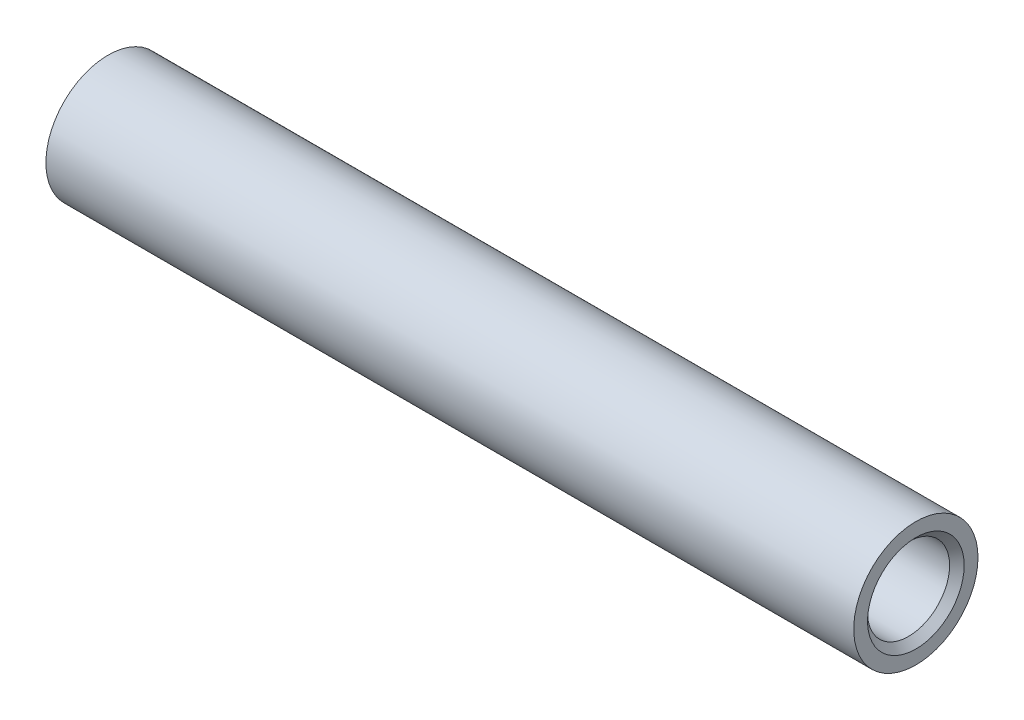
ISO-10303-21;
HEADER;
FILE_DESCRIPTION(('STEP AP214'),'2;1');
FILE_NAME('part.step','',(''),(''),'','','');
FILE_SCHEMA(('AUTOMOTIVE_DESIGN { 1 0 10303 214 1 1 1 1 }'));
ENDSEC;
DATA;
#1=APPLICATION_CONTEXT('core data for automotive mechanical design processes');
#2=APPLICATION_PROTOCOL_DEFINITION('international standard','automotive_design',2000,#1);
#3=PRODUCT_CONTEXT('',#1,'mechanical');
#4=PRODUCT('Part','Part','',(#3));
#5=PRODUCT_RELATED_PRODUCT_CATEGORY('part','',(#4));
#6=PRODUCT_DEFINITION_FORMATION('','',#4);
#7=PRODUCT_DEFINITION_CONTEXT('part definition',#1,'design');
#8=PRODUCT_DEFINITION('design','',#6,#7);
#9=PRODUCT_DEFINITION_SHAPE('','',#8);
#10=(LENGTH_UNIT() NAMED_UNIT(*) SI_UNIT(.MILLI.,.METRE.));
#11=(NAMED_UNIT(*) PLANE_ANGLE_UNIT() SI_UNIT($,.RADIAN.));
#12=(NAMED_UNIT(*) SI_UNIT($,.STERADIAN.) SOLID_ANGLE_UNIT());
#13=UNCERTAINTY_MEASURE_WITH_UNIT(LENGTH_MEASURE(1.E-05),#10,'distance_accuracy_value','');
#14=(GEOMETRIC_REPRESENTATION_CONTEXT(3) GLOBAL_UNCERTAINTY_ASSIGNED_CONTEXT((#13)) GLOBAL_UNIT_ASSIGNED_CONTEXT((#10,
#11,#12)) REPRESENTATION_CONTEXT('',''));
#15=CARTESIAN_POINT('',(0.,0.,0.));
#16=DIRECTION('',(0.,0.,1.));
#17=DIRECTION('',(1.,0.,0.));
#18=AXIS2_PLACEMENT_3D('',#15,#16,#17);
#19=CARTESIAN_POINT('',(65.,0.,0.));
#20=DIRECTION('',(-1.,0.,0.));
#21=DIRECTION('',(0.,0.,1.));
#22=AXIS2_PLACEMENT_3D('',#19,#20,#21);
#23=CYLINDRICAL_SURFACE('',#22,5.);
#24=CARTESIAN_POINT('',(65.,0.,0.));
#25=DIRECTION('',(1.,0.,0.));
#26=DIRECTION('',(0.,0.,-1.));
#27=AXIS2_PLACEMENT_3D('',#24,#25,#26);
#28=CIRCLE('',#27,5.);
#29=CARTESIAN_POINT('',(65.,0.,-5.));
#30=VERTEX_POINT('',#29);
#31=EDGE_CURVE('E11',#30,#30,#28,.T.);
#32=ORIENTED_EDGE('',*,*,#31,.F.);
#33=EDGE_LOOP('',(#32));
#34=FACE_BOUND('',#33,.T.);
#35=CARTESIAN_POINT('',(0.,0.,0.));
#36=DIRECTION('',(1.,0.,0.));
#37=DIRECTION('',(0.,0.,-1.));
#38=AXIS2_PLACEMENT_3D('',#35,#36,#37);
#39=CIRCLE('',#38,5.);
#40=CARTESIAN_POINT('',(0.,0.,-5.));
#41=VERTEX_POINT('',#40);
#42=EDGE_CURVE('E46',#41,#41,#39,.T.);
#43=ORIENTED_EDGE('',*,*,#42,.T.);
#44=EDGE_LOOP('',(#43));
#45=FACE_BOUND('',#44,.T.);
#46=ADVANCED_FACE('F43',(#34,#45),#23,.T.);
#47=CARTESIAN_POINT('',(65.,0.,0.));
#48=DIRECTION('',(1.,0.,0.));
#49=DIRECTION('',(0.,0.,-1.));
#50=AXIS2_PLACEMENT_3D('',#47,#48,#49);
#51=PLANE('',#50);
#52=CARTESIAN_POINT('',(65.,0.,0.));
#53=DIRECTION('',(1.,0.,0.));
#54=DIRECTION('',(0.,0.,-1.));
#55=AXIS2_PLACEMENT_3D('',#52,#53,#54);
#56=CIRCLE('',#55,3.8865);
#57=CARTESIAN_POINT('',(65.,0.,-3.8865));
#58=VERTEX_POINT('',#57);
#59=EDGE_CURVE('E77',#58,#58,#56,.T.);
#60=ORIENTED_EDGE('',*,*,#59,.F.);
#61=EDGE_LOOP('',(#60));
#62=FACE_BOUND('',#61,.T.);
#63=ORIENTED_EDGE('',*,*,#31,.T.);
#64=EDGE_LOOP('',(#63));
#65=FACE_BOUND('',#64,.T.);
#66=ADVANCED_FACE('F97',(#62,#65),#51,.T.);
#67=CARTESIAN_POINT('',(0.,0.,0.));
#68=DIRECTION('',(1.,0.,0.));
#69=DIRECTION('',(0.,0.,-1.));
#70=AXIS2_PLACEMENT_3D('',#67,#68,#69);
#71=PLANE('',#70);
#72=CARTESIAN_POINT('',(0.,0.,0.));
#73=DIRECTION('',(-1.,0.,0.));
#74=DIRECTION('',(0.,0.,1.));
#75=AXIS2_PLACEMENT_3D('',#72,#73,#74);
#76=CIRCLE('',#75,3.8865);
#77=CARTESIAN_POINT('',(0.,0.,3.8865));
#78=VERTEX_POINT('',#77);
#79=EDGE_CURVE('E68',#78,#78,#76,.T.);
#80=ORIENTED_EDGE('',*,*,#79,.F.);
#81=EDGE_LOOP('',(#80));
#82=FACE_BOUND('',#81,.T.);
#83=ORIENTED_EDGE('',*,*,#42,.F.);
#84=EDGE_LOOP('',(#83));
#85=FACE_BOUND('',#84,.T.);
#86=ADVANCED_FACE('F94',(#82,#85),#71,.F.);
#87=CARTESIAN_POINT('',(20.,0.,0.));
#88=DIRECTION('',(-1.,0.,0.));
#89=DIRECTION('',(0.,0.,1.));
#90=AXIS2_PLACEMENT_3D('',#87,#88,#89);
#91=CONICAL_SURFACE('',#90,3.3,1.02974425867665);
#92=CARTESIAN_POINT('',(21.982840042791,0.,0.));
#93=VERTEX_POINT('',#92);
#94=VERTEX_LOOP('',#93);
#95=FACE_BOUND('',#94,.T.);
#96=CARTESIAN_POINT('',(20.,0.,0.));
#97=DIRECTION('',(-1.,0.,0.));
#98=DIRECTION('',(0.,0.,1.));
#99=AXIS2_PLACEMENT_3D('',#96,#97,#98);
#100=CIRCLE('',#99,3.3);
#101=CARTESIAN_POINT('',(20.,0.,3.3));
#102=VERTEX_POINT('',#101);
#103=EDGE_CURVE('E84',#102,#102,#100,.T.);
#104=ORIENTED_EDGE('',*,*,#103,.T.);
#105=EDGE_LOOP('',(#104));
#106=FACE_BOUND('',#105,.T.);
#107=ADVANCED_FACE('F96',(#95,#106),#91,.F.);
#108=CARTESIAN_POINT('',(0.,0.,0.));
#109=DIRECTION('',(-1.,0.,0.));
#110=DIRECTION('',(0.,0.,1.));
#111=AXIS2_PLACEMENT_3D('',#108,#109,#110);
#112=CYLINDRICAL_SURFACE('',#111,3.3);
#113=ORIENTED_EDGE('',*,*,#103,.F.);
#114=EDGE_LOOP('',(#113));
#115=FACE_BOUND('',#114,.T.);
#116=CARTESIAN_POINT('',(0.5865,0.,0.));
#117=DIRECTION('',(-1.,0.,0.));
#118=DIRECTION('',(0.,0.,1.));
#119=AXIS2_PLACEMENT_3D('',#116,#117,#118);
#120=CIRCLE('',#119,3.3);
#121=CARTESIAN_POINT('',(0.5865,0.,3.3));
#122=VERTEX_POINT('',#121);
#123=EDGE_CURVE('E74',#122,#122,#120,.T.);
#124=ORIENTED_EDGE('',*,*,#123,.T.);
#125=EDGE_LOOP('',(#124));
#126=FACE_BOUND('',#125,.T.);
#127=ADVANCED_FACE('F103',(#115,#126),#112,.F.);
#128=CARTESIAN_POINT('',(0.,0.,0.));
#129=DIRECTION('',(-1.,0.,0.));
#130=DIRECTION('',(0.,0.,1.));
#131=AXIS2_PLACEMENT_3D('',#128,#129,#130);
#132=CONICAL_SURFACE('',#131,3.8865,0.785398163397448);
#133=ORIENTED_EDGE('',*,*,#123,.F.);
#134=EDGE_LOOP('',(#133));
#135=FACE_BOUND('',#134,.T.);
#136=ORIENTED_EDGE('',*,*,#79,.T.);
#137=EDGE_LOOP('',(#136));
#138=FACE_BOUND('',#137,.T.);
#139=ADVANCED_FACE('F61',(#135,#138),#132,.F.);
#140=CARTESIAN_POINT('',(45.,0.,0.));
#141=DIRECTION('',(1.,0.,0.));
#142=DIRECTION('',(0.,0.,-1.));
#143=AXIS2_PLACEMENT_3D('',#140,#141,#142);
#144=CONICAL_SURFACE('',#143,3.29999999999999,1.02974425867665);
#145=CARTESIAN_POINT('',(43.0171599572091,0.,0.));
#146=VERTEX_POINT('',#145);
#147=VERTEX_LOOP('',#146);
#148=FACE_BOUND('',#147,.T.);
#149=CARTESIAN_POINT('',(45.,0.,0.));
#150=DIRECTION('',(1.,0.,0.));
#151=DIRECTION('',(0.,0.,-1.));
#152=AXIS2_PLACEMENT_3D('',#149,#150,#151);
#153=CIRCLE('',#152,3.29999999999999);
#154=CARTESIAN_POINT('',(45.,0.,-3.29999999999999));
#155=VERTEX_POINT('',#154);
#156=EDGE_CURVE('E65',#155,#155,#153,.T.);
#157=ORIENTED_EDGE('',*,*,#156,.T.);
#158=EDGE_LOOP('',(#157));
#159=FACE_BOUND('',#158,.T.);
#160=ADVANCED_FACE('F57',(#148,#159),#144,.F.);
#161=CARTESIAN_POINT('',(65.,0.,0.));
#162=DIRECTION('',(1.,0.,0.));
#163=DIRECTION('',(0.,0.,-1.));
#164=AXIS2_PLACEMENT_3D('',#161,#162,#163);
#165=CYLINDRICAL_SURFACE('',#164,3.29999999999999);
#166=ORIENTED_EDGE('',*,*,#156,.F.);
#167=EDGE_LOOP('',(#166));
#168=FACE_BOUND('',#167,.T.);
#169=CARTESIAN_POINT('',(64.4135,0.,0.));
#170=DIRECTION('',(1.,0.,0.));
#171=DIRECTION('',(0.,0.,-1.));
#172=AXIS2_PLACEMENT_3D('',#169,#170,#171);
#173=CIRCLE('',#172,3.29999999999999);
#174=CARTESIAN_POINT('',(64.4135,0.,-3.29999999999999));
#175=VERTEX_POINT('',#174);
#176=EDGE_CURVE('E69',#175,#175,#173,.T.);
#177=ORIENTED_EDGE('',*,*,#176,.T.);
#178=EDGE_LOOP('',(#177));
#179=FACE_BOUND('',#178,.T.);
#180=ADVANCED_FACE('F60',(#168,#179),#165,.F.);
#181=CARTESIAN_POINT('',(65.,0.,0.));
#182=DIRECTION('',(1.,0.,0.));
#183=DIRECTION('',(0.,0.,-1.));
#184=AXIS2_PLACEMENT_3D('',#181,#182,#183);
#185=CONICAL_SURFACE('',#184,3.8865,0.785398163397442);
#186=ORIENTED_EDGE('',*,*,#176,.F.);
#187=EDGE_LOOP('',(#186));
#188=FACE_BOUND('',#187,.T.);
#189=ORIENTED_EDGE('',*,*,#59,.T.);
#190=EDGE_LOOP('',(#189));
#191=FACE_BOUND('',#190,.T.);
#192=ADVANCED_FACE('F140',(#188,#191),#185,.F.);
#193=CLOSED_SHELL('',(#46,#66,#86,#107,#127,#139,#160,#180,#192));
#194=MANIFOLD_SOLID_BREP('B2',#193);
#195=ADVANCED_BREP_SHAPE_REPRESENTATION('',(#18,#194),#14);
#196=SHAPE_DEFINITION_REPRESENTATION(#9,#195);
ENDSEC;
END-ISO-10303-21;
